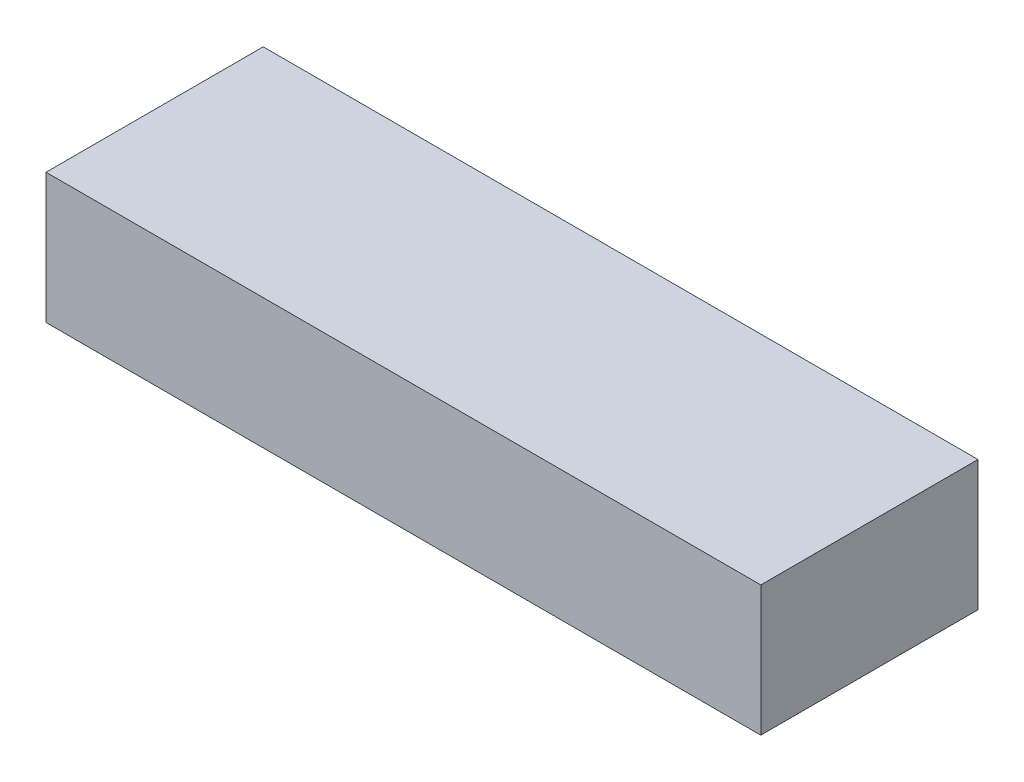
ISO-10303-21;
HEADER;
FILE_DESCRIPTION(('STEP AP214'),'2;1');
FILE_NAME('part.step','',(''),(''),'','','');
FILE_SCHEMA(('AUTOMOTIVE_DESIGN { 1 0 10303 214 1 1 1 1 }'));
ENDSEC;
DATA;
#1=APPLICATION_CONTEXT('core data for automotive mechanical design processes');
#2=APPLICATION_PROTOCOL_DEFINITION('international standard','automotive_design',2000,#1);
#3=PRODUCT_CONTEXT('',#1,'mechanical');
#4=PRODUCT('Part','Part','',(#3));
#5=PRODUCT_RELATED_PRODUCT_CATEGORY('part','',(#4));
#6=PRODUCT_DEFINITION_FORMATION('','',#4);
#7=PRODUCT_DEFINITION_CONTEXT('part definition',#1,'design');
#8=PRODUCT_DEFINITION('design','',#6,#7);
#9=PRODUCT_DEFINITION_SHAPE('','',#8);
#10=(LENGTH_UNIT() NAMED_UNIT(*) SI_UNIT(.MILLI.,.METRE.));
#11=(NAMED_UNIT(*) PLANE_ANGLE_UNIT() SI_UNIT($,.RADIAN.));
#12=(NAMED_UNIT(*) SI_UNIT($,.STERADIAN.) SOLID_ANGLE_UNIT());
#13=UNCERTAINTY_MEASURE_WITH_UNIT(LENGTH_MEASURE(1.E-05),#10,'distance_accuracy_value','');
#14=(GEOMETRIC_REPRESENTATION_CONTEXT(3) GLOBAL_UNCERTAINTY_ASSIGNED_CONTEXT((#13)) GLOBAL_UNIT_ASSIGNED_CONTEXT((#10,
#11,#12)) REPRESENTATION_CONTEXT('',''));
#15=CARTESIAN_POINT('',(0.,0.,0.));
#16=DIRECTION('',(0.,0.,1.));
#17=DIRECTION('',(1.,0.,0.));
#18=AXIS2_PLACEMENT_3D('',#15,#16,#17);
#19=CARTESIAN_POINT('',(-0.75520042,0.1375029,0.45899832));
#20=DIRECTION('',(0.,0.,1.));
#21=DIRECTION('',(1.,0.,0.));
#22=AXIS2_PLACEMENT_3D('',#19,#20,#21);
#23=PLANE('',#22);
#24=DIRECTION('',(1.,0.,0.));
#25=VECTOR('',#24,1.);
#26=CARTESIAN_POINT('',(-0.75520042,0.1375029,0.45899832));
#27=LINE('',#26,#25);
#28=CARTESIAN_POINT('',(-0.75520042,0.1375029,0.45899832));
#29=VERTEX_POINT('',#28);
#30=CARTESIAN_POINT('',(0.75520042,0.1375029,0.45899832));
#31=VERTEX_POINT('',#30);
#32=EDGE_CURVE('E21',#29,#31,#27,.T.);
#33=ORIENTED_EDGE('',*,*,#32,.F.);
#34=DIRECTION('',(0.,1.,0.));
#35=VECTOR('',#34,1.);
#36=CARTESIAN_POINT('',(-0.75520042,-0.13750036,0.45899832));
#37=LINE('',#36,#35);
#38=CARTESIAN_POINT('',(-0.75520042,-0.13750036,0.45899832));
#39=VERTEX_POINT('',#38);
#40=EDGE_CURVE('E28',#39,#29,#37,.T.);
#41=ORIENTED_EDGE('',*,*,#40,.F.);
#42=DIRECTION('',(-1.,0.,0.));
#43=VECTOR('',#42,1.);
#44=CARTESIAN_POINT('',(0.75520042,-0.13750036,0.45899832));
#45=LINE('',#44,#43);
#46=CARTESIAN_POINT('',(0.75520042,-0.13750036,0.45899832));
#47=VERTEX_POINT('',#46);
#48=EDGE_CURVE('E77',#47,#39,#45,.T.);
#49=ORIENTED_EDGE('',*,*,#48,.F.);
#50=DIRECTION('',(0.,-1.,0.));
#51=VECTOR('',#50,1.);
#52=CARTESIAN_POINT('',(0.75520042,0.1375029,0.45899832));
#53=LINE('',#52,#51);
#54=EDGE_CURVE('E95',#31,#47,#53,.T.);
#55=ORIENTED_EDGE('',*,*,#54,.F.);
#56=EDGE_LOOP('',(#33,#41,#49,#55));
#57=FACE_BOUND('',#56,.T.);
#58=ADVANCED_FACE('F17',(#57),#23,.T.);
#59=CARTESIAN_POINT('',(-0.75520042,0.1375029,0.));
#60=DIRECTION('',(0.,0.,1.));
#61=DIRECTION('',(1.,0.,0.));
#62=AXIS2_PLACEMENT_3D('',#59,#60,#61);
#63=PLANE('',#62);
#64=DIRECTION('',(1.,0.,0.));
#65=VECTOR('',#64,1.);
#66=CARTESIAN_POINT('',(-0.75520042,0.1375029,0.));
#67=LINE('',#66,#65);
#68=CARTESIAN_POINT('',(-0.75520042,0.1375029,0.));
#69=VERTEX_POINT('',#68);
#70=CARTESIAN_POINT('',(0.75520042,0.1375029,0.));
#71=VERTEX_POINT('',#70);
#72=EDGE_CURVE('E90',#69,#71,#67,.T.);
#73=ORIENTED_EDGE('',*,*,#72,.T.);
#74=DIRECTION('',(0.,-1.,0.));
#75=VECTOR('',#74,1.);
#76=CARTESIAN_POINT('',(0.75520042,0.1375029,0.));
#77=LINE('',#76,#75);
#78=CARTESIAN_POINT('',(0.75520042,-0.13750036,0.));
#79=VERTEX_POINT('',#78);
#80=EDGE_CURVE('E72',#71,#79,#77,.T.);
#81=ORIENTED_EDGE('',*,*,#80,.T.);
#82=DIRECTION('',(-1.,0.,0.));
#83=VECTOR('',#82,1.);
#84=CARTESIAN_POINT('',(0.75520042,-0.13750036,0.));
#85=LINE('',#84,#83);
#86=CARTESIAN_POINT('',(-0.75520042,-0.13750036,0.));
#87=VERTEX_POINT('',#86);
#88=EDGE_CURVE('E84',#79,#87,#85,.T.);
#89=ORIENTED_EDGE('',*,*,#88,.T.);
#90=DIRECTION('',(0.,1.,0.));
#91=VECTOR('',#90,1.);
#92=CARTESIAN_POINT('',(-0.75520042,-0.13750036,0.));
#93=LINE('',#92,#91);
#94=EDGE_CURVE('E11',#87,#69,#93,.T.);
#95=ORIENTED_EDGE('',*,*,#94,.T.);
#96=EDGE_LOOP('',(#73,#81,#89,#95));
#97=FACE_BOUND('',#96,.T.);
#98=ADVANCED_FACE('F19',(#97),#63,.F.);
#99=CARTESIAN_POINT('',(-0.75520042,-0.13750036,0.));
#100=DIRECTION('',(-1.,0.,0.));
#101=DIRECTION('',(0.,0.,1.));
#102=AXIS2_PLACEMENT_3D('',#99,#100,#101);
#103=PLANE('',#102);
#104=DIRECTION('',(0.,0.,1.));
#105=VECTOR('',#104,1.);
#106=CARTESIAN_POINT('',(-0.75520042,-0.13750036,0.));
#107=LINE('',#106,#105);
#108=EDGE_CURVE('E88',#87,#39,#107,.T.);
#109=ORIENTED_EDGE('',*,*,#108,.T.);
#110=ORIENTED_EDGE('',*,*,#40,.T.);
#111=DIRECTION('',(0.,0.,1.));
#112=VECTOR('',#111,1.);
#113=CARTESIAN_POINT('',(-0.75520042,0.1375029,0.));
#114=LINE('',#113,#112);
#115=EDGE_CURVE('E104',#69,#29,#114,.T.);
#116=ORIENTED_EDGE('',*,*,#115,.F.);
#117=ORIENTED_EDGE('',*,*,#94,.F.);
#118=EDGE_LOOP('',(#109,#110,#116,#117));
#119=FACE_BOUND('',#118,.T.);
#120=ADVANCED_FACE('F133',(#119),#103,.T.);
#121=CARTESIAN_POINT('',(0.75520042,-0.13750036,0.));
#122=DIRECTION('',(0.,-1.,0.));
#123=DIRECTION('',(0.,0.,-1.));
#124=AXIS2_PLACEMENT_3D('',#121,#122,#123);
#125=PLANE('',#124);
#126=DIRECTION('',(0.,0.,1.));
#127=VECTOR('',#126,1.);
#128=CARTESIAN_POINT('',(0.75520042,-0.13750036,0.));
#129=LINE('',#128,#127);
#130=EDGE_CURVE('E86',#79,#47,#129,.T.);
#131=ORIENTED_EDGE('',*,*,#130,.T.);
#132=ORIENTED_EDGE('',*,*,#48,.T.);
#133=ORIENTED_EDGE('',*,*,#108,.F.);
#134=ORIENTED_EDGE('',*,*,#88,.F.);
#135=EDGE_LOOP('',(#131,#132,#133,#134));
#136=FACE_BOUND('',#135,.T.);
#137=ADVANCED_FACE('F85',(#136),#125,.T.);
#138=CARTESIAN_POINT('',(0.75520042,0.1375029,0.));
#139=DIRECTION('',(1.,0.,0.));
#140=DIRECTION('',(0.,1.,0.));
#141=AXIS2_PLACEMENT_3D('',#138,#139,#140);
#142=PLANE('',#141);
#143=DIRECTION('',(0.,0.,1.));
#144=VECTOR('',#143,1.);
#145=CARTESIAN_POINT('',(0.75520042,0.1375029,0.));
#146=LINE('',#145,#144);
#147=EDGE_CURVE('E117',#71,#31,#146,.T.);
#148=ORIENTED_EDGE('',*,*,#147,.T.);
#149=ORIENTED_EDGE('',*,*,#54,.T.);
#150=ORIENTED_EDGE('',*,*,#130,.F.);
#151=ORIENTED_EDGE('',*,*,#80,.F.);
#152=EDGE_LOOP('',(#148,#149,#150,#151));
#153=FACE_BOUND('',#152,.T.);
#154=ADVANCED_FACE('F94',(#153),#142,.T.);
#155=CARTESIAN_POINT('',(-0.75520042,0.1375029,0.));
#156=DIRECTION('',(0.,1.,0.));
#157=DIRECTION('',(1.,0.,0.));
#158=AXIS2_PLACEMENT_3D('',#155,#156,#157);
#159=PLANE('',#158);
#160=ORIENTED_EDGE('',*,*,#115,.T.);
#161=ORIENTED_EDGE('',*,*,#32,.T.);
#162=ORIENTED_EDGE('',*,*,#147,.F.);
#163=ORIENTED_EDGE('',*,*,#72,.F.);
#164=EDGE_LOOP('',(#160,#161,#162,#163));
#165=FACE_BOUND('',#164,.T.);
#166=ADVANCED_FACE('F132',(#165),#159,.T.);
#167=CLOSED_SHELL('',(#58,#98,#120,#137,#154,#166));
#168=MANIFOLD_SOLID_BREP('B1',#167);
#169=ADVANCED_BREP_SHAPE_REPRESENTATION('',(#18,#168),#14);
#170=SHAPE_DEFINITION_REPRESENTATION(#9,#169);
ENDSEC;
END-ISO-10303-21;
